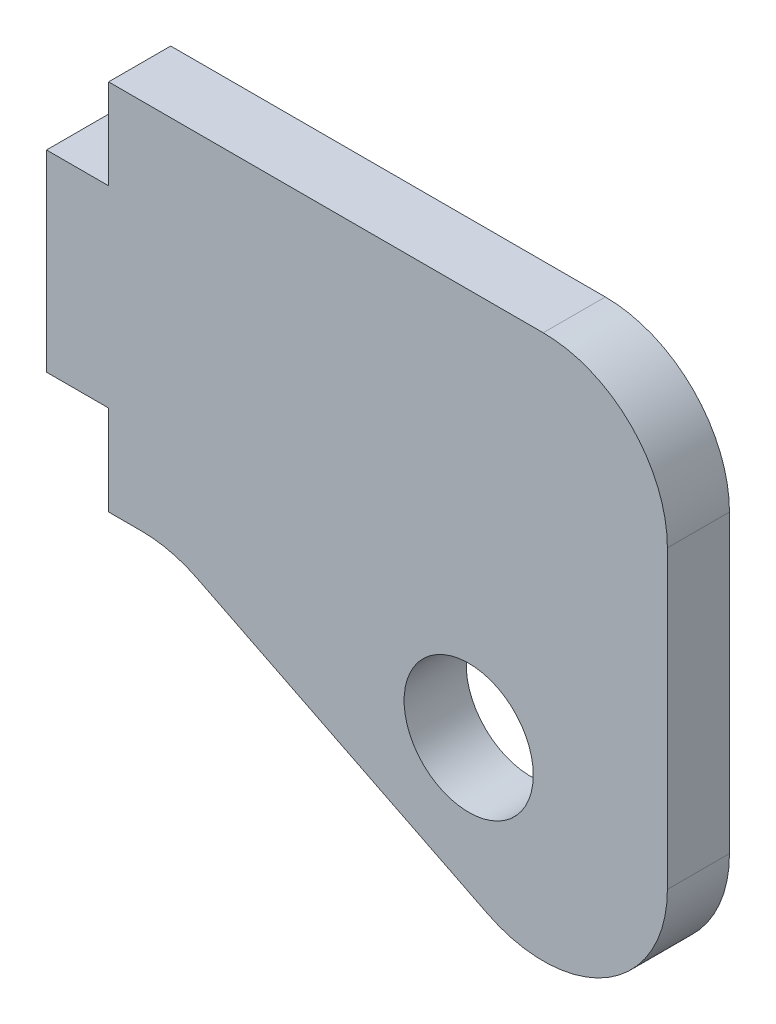
ISO-10303-21;
HEADER;
FILE_DESCRIPTION(('STEP AP214'),'2;1');
FILE_NAME('part.step','',(''),(''),'','','');
FILE_SCHEMA(('AUTOMOTIVE_DESIGN { 1 0 10303 214 1 1 1 1 }'));
ENDSEC;
DATA;
#1=APPLICATION_CONTEXT('core data for automotive mechanical design processes');
#2=APPLICATION_PROTOCOL_DEFINITION('international standard','automotive_design',2000,#1);
#3=PRODUCT_CONTEXT('',#1,'mechanical');
#4=PRODUCT('Part','Part','',(#3));
#5=PRODUCT_RELATED_PRODUCT_CATEGORY('part','',(#4));
#6=PRODUCT_DEFINITION_FORMATION('','',#4);
#7=PRODUCT_DEFINITION_CONTEXT('part definition',#1,'design');
#8=PRODUCT_DEFINITION('design','',#6,#7);
#9=PRODUCT_DEFINITION_SHAPE('','',#8);
#10=(LENGTH_UNIT() NAMED_UNIT(*) SI_UNIT(.MILLI.,.METRE.));
#11=(NAMED_UNIT(*) PLANE_ANGLE_UNIT() SI_UNIT($,.RADIAN.));
#12=(NAMED_UNIT(*) SI_UNIT($,.STERADIAN.) SOLID_ANGLE_UNIT());
#13=UNCERTAINTY_MEASURE_WITH_UNIT(LENGTH_MEASURE(1.E-05),#10,'distance_accuracy_value','');
#14=(GEOMETRIC_REPRESENTATION_CONTEXT(3) GLOBAL_UNCERTAINTY_ASSIGNED_CONTEXT((#13)) GLOBAL_UNIT_ASSIGNED_CONTEXT((#10,
#11,#12)) REPRESENTATION_CONTEXT('',''));
#15=CARTESIAN_POINT('',(0.,0.,0.));
#16=DIRECTION('',(0.,0.,1.));
#17=DIRECTION('',(1.,0.,0.));
#18=AXIS2_PLACEMENT_3D('',#15,#16,#17);
#19=CARTESIAN_POINT('',(31.75,9.525,3.175));
#20=DIRECTION('',(0.,-1.,0.));
#21=DIRECTION('',(1.,0.,0.));
#22=AXIS2_PLACEMENT_3D('',#19,#20,#21);
#23=PLANE('',#22);
#24=DIRECTION('',(-1.,0.,0.));
#25=VECTOR('',#24,1.);
#26=CARTESIAN_POINT('',(31.75,9.525,0.));
#27=LINE('',#26,#25);
#28=CARTESIAN_POINT('',(25.4,9.525,0.));
#29=VERTEX_POINT('',#28);
#30=CARTESIAN_POINT('',(3.175,9.525,0.));
#31=VERTEX_POINT('',#30);
#32=EDGE_CURVE('E148',#29,#31,#27,.T.);
#33=ORIENTED_EDGE('',*,*,#32,.T.);
#34=DIRECTION('',(0.,0.,1.));
#35=VECTOR('',#34,1.);
#36=CARTESIAN_POINT('',(3.175,9.525,0.));
#37=LINE('',#36,#35);
#38=CARTESIAN_POINT('',(3.175,9.525,3.175));
#39=VERTEX_POINT('',#38);
#40=EDGE_CURVE('E239',#31,#39,#37,.T.);
#41=ORIENTED_EDGE('',*,*,#40,.T.);
#42=DIRECTION('',(-1.,0.,0.));
#43=VECTOR('',#42,1.);
#44=CARTESIAN_POINT('',(31.75,9.525,3.175));
#45=LINE('',#44,#43);
#46=CARTESIAN_POINT('',(25.4,9.525,3.175));
#47=VERTEX_POINT('',#46);
#48=EDGE_CURVE('E154',#47,#39,#45,.T.);
#49=ORIENTED_EDGE('',*,*,#48,.F.);
#50=DIRECTION('',(0.,0.,-1.));
#51=VECTOR('',#50,1.);
#52=CARTESIAN_POINT('',(25.4,9.525,3.175));
#53=LINE('',#52,#51);
#54=EDGE_CURVE('E155',#47,#29,#53,.T.);
#55=ORIENTED_EDGE('',*,*,#54,.T.);
#56=EDGE_LOOP('',(#33,#41,#49,#55));
#57=FACE_BOUND('',#56,.T.);
#58=ADVANCED_FACE('F32',(#57),#23,.F.);
#59=CARTESIAN_POINT('',(0.,9.525,3.175));
#60=DIRECTION('',(1.,0.,0.));
#61=DIRECTION('',(0.,0.,-1.));
#62=AXIS2_PLACEMENT_3D('',#59,#60,#61);
#63=PLANE('',#62);
#64=DIRECTION('',(0.,-1.,0.));
#65=VECTOR('',#64,1.);
#66=CARTESIAN_POINT('',(0.,9.525,0.));
#67=LINE('',#66,#65);
#68=CARTESIAN_POINT('',(0.,4.92125,0.));
#69=VERTEX_POINT('',#68);
#70=CARTESIAN_POINT('',(0.,-4.92125,0.));
#71=VERTEX_POINT('',#70);
#72=EDGE_CURVE('E142',#69,#71,#67,.T.);
#73=ORIENTED_EDGE('',*,*,#72,.T.);
#74=DIRECTION('',(0.,0.,1.));
#75=VECTOR('',#74,1.);
#76=CARTESIAN_POINT('',(0.,-4.92125,0.));
#77=LINE('',#76,#75);
#78=CARTESIAN_POINT('',(0.,-4.92125,3.175));
#79=VERTEX_POINT('',#78);
#80=EDGE_CURVE('E209',#71,#79,#77,.T.);
#81=ORIENTED_EDGE('',*,*,#80,.T.);
#82=DIRECTION('',(0.,-1.,0.));
#83=VECTOR('',#82,1.);
#84=CARTESIAN_POINT('',(0.,9.525,3.175));
#85=LINE('',#84,#83);
#86=CARTESIAN_POINT('',(0.,4.92125,3.175));
#87=VERTEX_POINT('',#86);
#88=EDGE_CURVE('E195',#87,#79,#85,.T.);
#89=ORIENTED_EDGE('',*,*,#88,.F.);
#90=DIRECTION('',(0.,0.,1.));
#91=VECTOR('',#90,1.);
#92=CARTESIAN_POINT('',(0.,4.92125,0.));
#93=LINE('',#92,#91);
#94=EDGE_CURVE('E212',#69,#87,#93,.T.);
#95=ORIENTED_EDGE('',*,*,#94,.F.);
#96=EDGE_LOOP('',(#73,#81,#89,#95));
#97=FACE_BOUND('',#96,.T.);
#98=ADVANCED_FACE('F225',(#97),#63,.F.);
#99=CARTESIAN_POINT('',(0.,-9.525,3.175));
#100=DIRECTION('',(0.,1.,0.));
#101=DIRECTION('',(0.,0.,1.));
#102=AXIS2_PLACEMENT_3D('',#99,#100,#101);
#103=PLANE('',#102);
#104=DIRECTION('',(1.,0.,0.));
#105=VECTOR('',#104,1.);
#106=CARTESIAN_POINT('',(0.,-9.525,3.175));
#107=LINE('',#106,#105);
#108=CARTESIAN_POINT('',(3.175,-9.525,3.175));
#109=VERTEX_POINT('',#108);
#110=CARTESIAN_POINT('',(4.85096834287634,-9.525,3.175));
#111=VERTEX_POINT('',#110);
#112=EDGE_CURVE('E136',#109,#111,#107,.T.);
#113=ORIENTED_EDGE('',*,*,#112,.F.);
#114=DIRECTION('',(0.,0.,1.));
#115=VECTOR('',#114,1.);
#116=CARTESIAN_POINT('',(3.175,-9.525,0.));
#117=LINE('',#116,#115);
#118=CARTESIAN_POINT('',(3.175,-9.525,0.));
#119=VERTEX_POINT('',#118);
#120=EDGE_CURVE('E123',#119,#109,#117,.T.);
#121=ORIENTED_EDGE('',*,*,#120,.F.);
#122=DIRECTION('',(1.,0.,0.));
#123=VECTOR('',#122,1.);
#124=CARTESIAN_POINT('',(0.,-9.525,0.));
#125=LINE('',#124,#123);
#126=CARTESIAN_POINT('',(4.85096834287634,-9.525,0.));
#127=VERTEX_POINT('',#126);
#128=EDGE_CURVE('E134',#119,#127,#125,.T.);
#129=ORIENTED_EDGE('',*,*,#128,.T.);
#130=DIRECTION('',(0.,0.,-1.));
#131=VECTOR('',#130,1.);
#132=CARTESIAN_POINT('',(4.85096834287634,-9.525,3.175));
#133=LINE('',#132,#131);
#134=EDGE_CURVE('E177',#127,#111,#133,.F.);
#135=ORIENTED_EDGE('',*,*,#134,.T.);
#136=EDGE_LOOP('',(#113,#121,#129,#135));
#137=FACE_BOUND('',#136,.T.);
#138=ADVANCED_FACE('F132',(#137),#103,.F.);
#139=CARTESIAN_POINT('',(6.35,-9.525,3.175));
#140=DIRECTION('',(0.447213595499958,0.894427190999916,0.));
#141=DIRECTION('',(-0.894427190999916,0.447213595499958,0.));
#142=AXIS2_PLACEMENT_3D('',#139,#140,#141);
#143=PLANE('',#142);
#144=DIRECTION('',(0.894427190999916,-0.447213595499958,0.));
#145=VECTOR('',#144,1.);
#146=CARTESIAN_POINT('',(6.35,-9.525,0.));
#147=LINE('',#146,#145);
#148=CARTESIAN_POINT('',(7.69077467430107,-10.1953873371505,0.));
#149=VERTEX_POINT('',#148);
#150=CARTESIAN_POINT('',(22.5601936685753,-17.6300968342876,0.));
#151=VERTEX_POINT('',#150);
#152=EDGE_CURVE('E141',#149,#151,#147,.T.);
#153=ORIENTED_EDGE('',*,*,#152,.T.);
#154=DIRECTION('',(0.,0.,-1.));
#155=VECTOR('',#154,1.);
#156=CARTESIAN_POINT('',(22.5601936685753,-17.6300968342876,3.175));
#157=LINE('',#156,#155);
#158=CARTESIAN_POINT('',(22.5601936685753,-17.6300968342876,3.175));
#159=VERTEX_POINT('',#158);
#160=EDGE_CURVE('E175',#151,#159,#157,.F.);
#161=ORIENTED_EDGE('',*,*,#160,.T.);
#162=DIRECTION('',(0.894427190999916,-0.447213595499958,0.));
#163=VECTOR('',#162,1.);
#164=CARTESIAN_POINT('',(6.35,-9.525,3.175));
#165=LINE('',#164,#163);
#166=CARTESIAN_POINT('',(7.69077467430107,-10.1953873371505,3.175));
#167=VERTEX_POINT('',#166);
#168=EDGE_CURVE('E187',#167,#159,#165,.T.);
#169=ORIENTED_EDGE('',*,*,#168,.F.);
#170=DIRECTION('',(0.,0.,-1.));
#171=VECTOR('',#170,1.);
#172=CARTESIAN_POINT('',(7.69077467430107,-10.1953873371505,0.));
#173=LINE('',#172,#171);
#174=EDGE_CURVE('E172',#167,#149,#173,.T.);
#175=ORIENTED_EDGE('',*,*,#174,.T.);
#176=EDGE_LOOP('',(#153,#161,#169,#175));
#177=FACE_BOUND('',#176,.T.);
#178=ADVANCED_FACE('F190',(#177),#143,.F.);
#179=CARTESIAN_POINT('',(31.75,-22.225,3.175));
#180=DIRECTION('',(-1.,0.,0.));
#181=DIRECTION('',(0.,0.,1.));
#182=AXIS2_PLACEMENT_3D('',#179,#180,#181);
#183=PLANE('',#182);
#184=DIRECTION('',(0.,1.,0.));
#185=VECTOR('',#184,1.);
#186=CARTESIAN_POINT('',(31.75,-22.225,0.));
#187=LINE('',#186,#185);
#188=CARTESIAN_POINT('',(31.75,-11.9504841714382,0.));
#189=VERTEX_POINT('',#188);
#190=CARTESIAN_POINT('',(31.75,3.175,0.));
#191=VERTEX_POINT('',#190);
#192=EDGE_CURVE('E145',#189,#191,#187,.T.);
#193=ORIENTED_EDGE('',*,*,#192,.T.);
#194=DIRECTION('',(0.,0.,-1.));
#195=VECTOR('',#194,1.);
#196=CARTESIAN_POINT('',(31.75,3.175,3.175));
#197=LINE('',#196,#195);
#198=CARTESIAN_POINT('',(31.75,3.175,3.175));
#199=VERTEX_POINT('',#198);
#200=EDGE_CURVE('E166',#191,#199,#197,.F.);
#201=ORIENTED_EDGE('',*,*,#200,.T.);
#202=DIRECTION('',(0.,1.,0.));
#203=VECTOR('',#202,1.);
#204=CARTESIAN_POINT('',(31.75,-22.225,3.175));
#205=LINE('',#204,#203);
#206=CARTESIAN_POINT('',(31.75,-11.9504841714382,3.175));
#207=VERTEX_POINT('',#206);
#208=EDGE_CURVE('E159',#207,#199,#205,.T.);
#209=ORIENTED_EDGE('',*,*,#208,.F.);
#210=DIRECTION('',(0.,0.,-1.));
#211=VECTOR('',#210,1.);
#212=CARTESIAN_POINT('',(31.75,-11.9504841714382,3.175));
#213=LINE('',#212,#211);
#214=EDGE_CURVE('E163',#207,#189,#213,.T.);
#215=ORIENTED_EDGE('',*,*,#214,.T.);
#216=EDGE_LOOP('',(#193,#201,#209,#215));
#217=FACE_BOUND('',#216,.T.);
#218=ADVANCED_FACE('F277',(#217),#183,.F.);
#219=CARTESIAN_POINT('',(0.,0.,3.175));
#220=DIRECTION('',(0.,0.,1.));
#221=DIRECTION('',(1.,0.,0.));
#222=AXIS2_PLACEMENT_3D('',#219,#220,#221);
#223=PLANE('',#222);
#224=DIRECTION('',(-1.,0.,0.));
#225=VECTOR('',#224,1.);
#226=CARTESIAN_POINT('',(0.,-4.92125,3.175));
#227=LINE('',#226,#225);
#228=CARTESIAN_POINT('',(3.175,-4.92125,3.175));
#229=VERTEX_POINT('',#228);
#230=EDGE_CURVE('E128',#229,#79,#227,.T.);
#231=ORIENTED_EDGE('',*,*,#230,.F.);
#232=DIRECTION('',(0.,1.,0.));
#233=VECTOR('',#232,1.);
#234=CARTESIAN_POINT('',(3.175,-9.525,3.175));
#235=LINE('',#234,#233);
#236=EDGE_CURVE('E240',#109,#229,#235,.T.);
#237=ORIENTED_EDGE('',*,*,#236,.F.);
#238=ORIENTED_EDGE('',*,*,#112,.T.);
#239=CARTESIAN_POINT('',(4.85096834287634,-15.875,3.175));
#240=DIRECTION('',(0.,0.,1.));
#241=DIRECTION('',(1.,0.,0.));
#242=AXIS2_PLACEMENT_3D('',#239,#240,#241);
#243=CIRCLE('',#242,6.35);
#244=EDGE_CURVE('E11',#111,#167,#243,.F.);
#245=ORIENTED_EDGE('',*,*,#244,.T.);
#246=ORIENTED_EDGE('',*,*,#168,.T.);
#247=CARTESIAN_POINT('',(25.4,-11.9504841714382,3.175));
#248=DIRECTION('',(0.,0.,1.));
#249=DIRECTION('',(1.,0.,0.));
#250=AXIS2_PLACEMENT_3D('',#247,#248,#249);
#251=CIRCLE('',#250,6.35);
#252=EDGE_CURVE('E168',#159,#207,#251,.T.);
#253=ORIENTED_EDGE('',*,*,#252,.T.);
#254=ORIENTED_EDGE('',*,*,#208,.T.);
#255=CARTESIAN_POINT('',(25.4,3.175,3.175));
#256=DIRECTION('',(0.,0.,1.));
#257=DIRECTION('',(1.,0.,0.));
#258=AXIS2_PLACEMENT_3D('',#255,#256,#257);
#259=CIRCLE('',#258,6.35);
#260=EDGE_CURVE('E170',#199,#47,#259,.T.);
#261=ORIENTED_EDGE('',*,*,#260,.T.);
#262=ORIENTED_EDGE('',*,*,#48,.T.);
#263=DIRECTION('',(0.,1.,0.));
#264=VECTOR('',#263,1.);
#265=CARTESIAN_POINT('',(3.175,9.525,3.175));
#266=LINE('',#265,#264);
#267=CARTESIAN_POINT('',(3.175,4.92125,3.175));
#268=VERTEX_POINT('',#267);
#269=EDGE_CURVE('E235',#268,#39,#266,.T.);
#270=ORIENTED_EDGE('',*,*,#269,.F.);
#271=DIRECTION('',(1.,0.,0.));
#272=VECTOR('',#271,1.);
#273=CARTESIAN_POINT('',(0.,4.92125,3.175));
#274=LINE('',#273,#272);
#275=EDGE_CURVE('E221',#87,#268,#274,.T.);
#276=ORIENTED_EDGE('',*,*,#275,.F.);
#277=ORIENTED_EDGE('',*,*,#88,.T.);
#278=EDGE_LOOP('',(#231,#237,#238,#245,#246,#253,#254,#261,#262,#270,#276,#277));
#279=FACE_BOUND('',#278,.T.);
#280=CARTESIAN_POINT('',(21.5882999780129,-10.315871598903,3.175));
#281=DIRECTION('',(0.,0.,1.));
#282=DIRECTION('',(1.,0.,0.));
#283=AXIS2_PLACEMENT_3D('',#280,#281,#282);
#284=CIRCLE('',#283,3.302);
#285=CARTESIAN_POINT('',(24.8902999780129,-10.315871598903,3.175));
#286=VERTEX_POINT('',#285);
#287=EDGE_CURVE('E204',#286,#286,#284,.T.);
#288=ORIENTED_EDGE('',*,*,#287,.F.);
#289=EDGE_LOOP('',(#288));
#290=FACE_BOUND('',#289,.T.);
#291=ADVANCED_FACE('F185',(#279,#290),#223,.T.);
#292=CARTESIAN_POINT('',(0.,0.,0.));
#293=DIRECTION('',(0.,0.,1.));
#294=DIRECTION('',(1.,0.,0.));
#295=AXIS2_PLACEMENT_3D('',#292,#293,#294);
#296=PLANE('',#295);
#297=CARTESIAN_POINT('',(21.5882999780129,-10.315871598903,0.));
#298=DIRECTION('',(0.,0.,1.));
#299=DIRECTION('',(1.,0.,0.));
#300=AXIS2_PLACEMENT_3D('',#297,#298,#299);
#301=CIRCLE('',#300,3.302);
#302=CARTESIAN_POINT('',(24.8902999780129,-10.315871598903,0.));
#303=VERTEX_POINT('',#302);
#304=EDGE_CURVE('E199',#303,#303,#301,.T.);
#305=ORIENTED_EDGE('',*,*,#304,.T.);
#306=EDGE_LOOP('',(#305));
#307=FACE_BOUND('',#306,.T.);
#308=DIRECTION('',(0.,1.,0.));
#309=VECTOR('',#308,1.);
#310=CARTESIAN_POINT('',(3.175,-9.525,0.));
#311=LINE('',#310,#309);
#312=CARTESIAN_POINT('',(3.175,-4.92125,0.));
#313=VERTEX_POINT('',#312);
#314=EDGE_CURVE('E119',#119,#313,#311,.T.);
#315=ORIENTED_EDGE('',*,*,#314,.T.);
#316=DIRECTION('',(-1.,0.,0.));
#317=VECTOR('',#316,1.);
#318=CARTESIAN_POINT('',(0.,-4.92125,0.));
#319=LINE('',#318,#317);
#320=EDGE_CURVE('E47',#313,#71,#319,.T.);
#321=ORIENTED_EDGE('',*,*,#320,.T.);
#322=ORIENTED_EDGE('',*,*,#72,.F.);
#323=DIRECTION('',(1.,0.,0.));
#324=VECTOR('',#323,1.);
#325=CARTESIAN_POINT('',(0.,4.92125,0.));
#326=LINE('',#325,#324);
#327=CARTESIAN_POINT('',(3.175,4.92125,0.));
#328=VERTEX_POINT('',#327);
#329=EDGE_CURVE('E232',#69,#328,#326,.T.);
#330=ORIENTED_EDGE('',*,*,#329,.T.);
#331=DIRECTION('',(0.,1.,0.));
#332=VECTOR('',#331,1.);
#333=CARTESIAN_POINT('',(3.175,9.525,0.));
#334=LINE('',#333,#332);
#335=EDGE_CURVE('E55',#328,#31,#334,.T.);
#336=ORIENTED_EDGE('',*,*,#335,.T.);
#337=ORIENTED_EDGE('',*,*,#32,.F.);
#338=CARTESIAN_POINT('',(25.4,3.175,0.));
#339=DIRECTION('',(0.,0.,1.));
#340=DIRECTION('',(1.,0.,0.));
#341=AXIS2_PLACEMENT_3D('',#338,#339,#340);
#342=CIRCLE('',#341,6.35);
#343=EDGE_CURVE('E161',#29,#191,#342,.F.);
#344=ORIENTED_EDGE('',*,*,#343,.T.);
#345=ORIENTED_EDGE('',*,*,#192,.F.);
#346=CARTESIAN_POINT('',(25.4,-11.9504841714382,0.));
#347=DIRECTION('',(0.,0.,1.));
#348=DIRECTION('',(1.,0.,0.));
#349=AXIS2_PLACEMENT_3D('',#346,#347,#348);
#350=CIRCLE('',#349,6.35);
#351=EDGE_CURVE('E158',#189,#151,#350,.F.);
#352=ORIENTED_EDGE('',*,*,#351,.T.);
#353=ORIENTED_EDGE('',*,*,#152,.F.);
#354=CARTESIAN_POINT('',(4.85096834287634,-15.875,0.));
#355=DIRECTION('',(0.,0.,1.));
#356=DIRECTION('',(1.,0.,0.));
#357=AXIS2_PLACEMENT_3D('',#354,#355,#356);
#358=CIRCLE('',#357,6.35);
#359=EDGE_CURVE('E40',#149,#127,#358,.T.);
#360=ORIENTED_EDGE('',*,*,#359,.T.);
#361=ORIENTED_EDGE('',*,*,#128,.F.);
#362=EDGE_LOOP('',(#315,#321,#322,#330,#336,#337,#344,#345,#352,#353,#360,#361));
#363=FACE_BOUND('',#362,.T.);
#364=ADVANCED_FACE('F138',(#307,#363),#296,.F.);
#365=CARTESIAN_POINT('',(25.4,3.175,3.175));
#366=DIRECTION('',(0.,0.,-1.));
#367=DIRECTION('',(-1.,0.,0.));
#368=AXIS2_PLACEMENT_3D('',#365,#366,#367);
#369=CYLINDRICAL_SURFACE('',#368,6.35);
#370=ORIENTED_EDGE('',*,*,#260,.F.);
#371=ORIENTED_EDGE('',*,*,#200,.F.);
#372=ORIENTED_EDGE('',*,*,#343,.F.);
#373=ORIENTED_EDGE('',*,*,#54,.F.);
#374=EDGE_LOOP('',(#370,#371,#372,#373));
#375=FACE_BOUND('',#374,.T.);
#376=ADVANCED_FACE('F263',(#375),#369,.T.);
#377=CARTESIAN_POINT('',(25.4,-11.9504841714382,3.175));
#378=DIRECTION('',(0.,0.,-1.));
#379=DIRECTION('',(-1.,0.,0.));
#380=AXIS2_PLACEMENT_3D('',#377,#378,#379);
#381=CYLINDRICAL_SURFACE('',#380,6.35);
#382=ORIENTED_EDGE('',*,*,#252,.F.);
#383=ORIENTED_EDGE('',*,*,#160,.F.);
#384=ORIENTED_EDGE('',*,*,#351,.F.);
#385=ORIENTED_EDGE('',*,*,#214,.F.);
#386=EDGE_LOOP('',(#382,#383,#384,#385));
#387=FACE_BOUND('',#386,.T.);
#388=ADVANCED_FACE('F265',(#387),#381,.T.);
#389=CARTESIAN_POINT('',(4.85096834287634,-15.875,3.175));
#390=DIRECTION('',(0.,0.,1.));
#391=DIRECTION('',(1.,0.,0.));
#392=AXIS2_PLACEMENT_3D('',#389,#390,#391);
#393=CYLINDRICAL_SURFACE('',#392,6.35);
#394=ORIENTED_EDGE('',*,*,#244,.F.);
#395=ORIENTED_EDGE('',*,*,#134,.F.);
#396=ORIENTED_EDGE('',*,*,#359,.F.);
#397=ORIENTED_EDGE('',*,*,#174,.F.);
#398=EDGE_LOOP('',(#394,#395,#396,#397));
#399=FACE_BOUND('',#398,.T.);
#400=ADVANCED_FACE('F34',(#399),#393,.F.);
#401=CARTESIAN_POINT('',(21.5882999780129,-10.315871598903,0.));
#402=DIRECTION('',(0.,0.,1.));
#403=DIRECTION('',(1.,0.,0.));
#404=AXIS2_PLACEMENT_3D('',#401,#402,#403);
#405=CYLINDRICAL_SURFACE('',#404,3.302);
#406=ORIENTED_EDGE('',*,*,#304,.F.);
#407=EDGE_LOOP('',(#406));
#408=FACE_BOUND('',#407,.T.);
#409=ORIENTED_EDGE('',*,*,#287,.T.);
#410=EDGE_LOOP('',(#409));
#411=FACE_BOUND('',#410,.T.);
#412=ADVANCED_FACE('F272',(#408,#411),#405,.F.);
#413=CARTESIAN_POINT('',(3.175,9.525,0.));
#414=DIRECTION('',(1.,0.,0.));
#415=DIRECTION('',(0.,0.,-1.));
#416=AXIS2_PLACEMENT_3D('',#413,#414,#415);
#417=PLANE('',#416);
#418=ORIENTED_EDGE('',*,*,#269,.T.);
#419=ORIENTED_EDGE('',*,*,#40,.F.);
#420=ORIENTED_EDGE('',*,*,#335,.F.);
#421=DIRECTION('',(0.,0.,1.));
#422=VECTOR('',#421,1.);
#423=CARTESIAN_POINT('',(3.175,4.92125,0.));
#424=LINE('',#423,#422);
#425=EDGE_CURVE('E241',#328,#268,#424,.T.);
#426=ORIENTED_EDGE('',*,*,#425,.T.);
#427=EDGE_LOOP('',(#418,#419,#420,#426));
#428=FACE_BOUND('',#427,.T.);
#429=ADVANCED_FACE('F253',(#428),#417,.F.);
#430=CARTESIAN_POINT('',(0.,4.92125,0.));
#431=DIRECTION('',(0.,-1.,0.));
#432=DIRECTION('',(0.,0.,-1.));
#433=AXIS2_PLACEMENT_3D('',#430,#431,#432);
#434=PLANE('',#433);
#435=ORIENTED_EDGE('',*,*,#275,.T.);
#436=ORIENTED_EDGE('',*,*,#425,.F.);
#437=ORIENTED_EDGE('',*,*,#329,.F.);
#438=ORIENTED_EDGE('',*,*,#94,.T.);
#439=EDGE_LOOP('',(#435,#436,#437,#438));
#440=FACE_BOUND('',#439,.T.);
#441=ADVANCED_FACE('F243',(#440),#434,.F.);
#442=CARTESIAN_POINT('',(0.,-4.92125,0.));
#443=DIRECTION('',(0.,1.,0.));
#444=DIRECTION('',(0.,0.,1.));
#445=AXIS2_PLACEMENT_3D('',#442,#443,#444);
#446=PLANE('',#445);
#447=ORIENTED_EDGE('',*,*,#230,.T.);
#448=ORIENTED_EDGE('',*,*,#80,.F.);
#449=ORIENTED_EDGE('',*,*,#320,.F.);
#450=DIRECTION('',(0.,0.,1.));
#451=VECTOR('',#450,1.);
#452=CARTESIAN_POINT('',(3.175,-4.92125,0.));
#453=LINE('',#452,#451);
#454=EDGE_CURVE('E125',#313,#229,#453,.T.);
#455=ORIENTED_EDGE('',*,*,#454,.T.);
#456=EDGE_LOOP('',(#447,#448,#449,#455));
#457=FACE_BOUND('',#456,.T.);
#458=ADVANCED_FACE('F245',(#457),#446,.F.);
#459=CARTESIAN_POINT('',(3.175,-9.525,0.));
#460=DIRECTION('',(1.,0.,0.));
#461=DIRECTION('',(0.,1.,0.));
#462=AXIS2_PLACEMENT_3D('',#459,#460,#461);
#463=PLANE('',#462);
#464=ORIENTED_EDGE('',*,*,#236,.T.);
#465=ORIENTED_EDGE('',*,*,#454,.F.);
#466=ORIENTED_EDGE('',*,*,#314,.F.);
#467=ORIENTED_EDGE('',*,*,#120,.T.);
#468=EDGE_LOOP('',(#464,#465,#466,#467));
#469=FACE_BOUND('',#468,.T.);
#470=ADVANCED_FACE('F122',(#469),#463,.F.);
#471=CLOSED_SHELL('',(#58,#98,#138,#178,#218,#291,#364,#376,#388,#400,#412,#429,#441,#458,#470));
#472=MANIFOLD_SOLID_BREP('B2',#471);
#473=ADVANCED_BREP_SHAPE_REPRESENTATION('',(#18,#472),#14);
#474=SHAPE_DEFINITION_REPRESENTATION(#9,#473);
ENDSEC;
END-ISO-10303-21;
